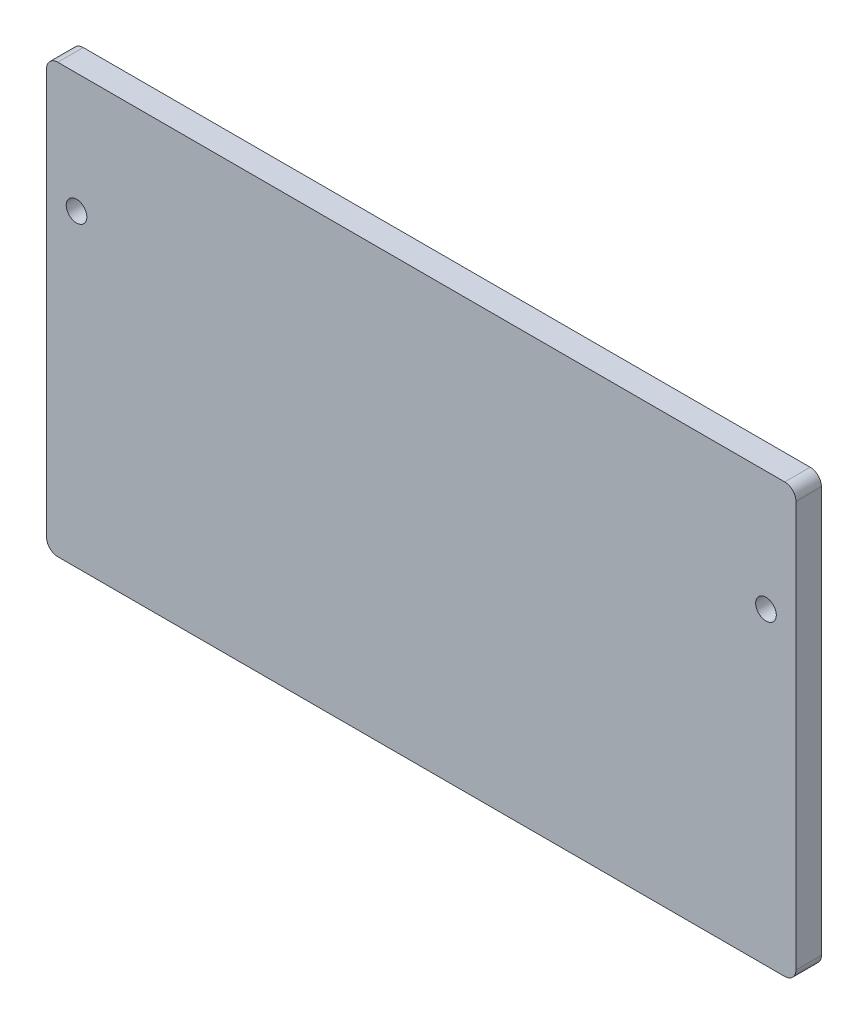
ISO-10303-21;
HEADER;
FILE_DESCRIPTION(('STEP AP214'),'2;1');
FILE_NAME('part.step','',(''),(''),'','','');
FILE_SCHEMA(('AUTOMOTIVE_DESIGN { 1 0 10303 214 1 1 1 1 }'));
ENDSEC;
DATA;
#1=APPLICATION_CONTEXT('core data for automotive mechanical design processes');
#2=APPLICATION_PROTOCOL_DEFINITION('international standard','automotive_design',2000,#1);
#3=PRODUCT_CONTEXT('',#1,'mechanical');
#4=PRODUCT('Part','Part','',(#3));
#5=PRODUCT_RELATED_PRODUCT_CATEGORY('part','',(#4));
#6=PRODUCT_DEFINITION_FORMATION('','',#4);
#7=PRODUCT_DEFINITION_CONTEXT('part definition',#1,'design');
#8=PRODUCT_DEFINITION('design','',#6,#7);
#9=PRODUCT_DEFINITION_SHAPE('','',#8);
#10=(LENGTH_UNIT() NAMED_UNIT(*) SI_UNIT(.MILLI.,.METRE.));
#11=(NAMED_UNIT(*) PLANE_ANGLE_UNIT() SI_UNIT($,.RADIAN.));
#12=(NAMED_UNIT(*) SI_UNIT($,.STERADIAN.) SOLID_ANGLE_UNIT());
#13=UNCERTAINTY_MEASURE_WITH_UNIT(LENGTH_MEASURE(1.E-05),#10,'distance_accuracy_value','');
#14=(GEOMETRIC_REPRESENTATION_CONTEXT(3) GLOBAL_UNCERTAINTY_ASSIGNED_CONTEXT((#13)) GLOBAL_UNIT_ASSIGNED_CONTEXT((#10,
#11,#12)) REPRESENTATION_CONTEXT('',''));
#15=CARTESIAN_POINT('',(0.,0.,0.));
#16=DIRECTION('',(0.,0.,1.));
#17=DIRECTION('',(1.,0.,0.));
#18=AXIS2_PLACEMENT_3D('',#15,#16,#17);
#19=CARTESIAN_POINT('',(0.,0.,6.8));
#20=DIRECTION('',(0.,0.,1.));
#21=DIRECTION('',(1.,0.,0.));
#22=AXIS2_PLACEMENT_3D('',#19,#20,#21);
#23=PLANE('',#22);
#24=CARTESIAN_POINT('',(92.,25.25,6.8));
#25=DIRECTION('',(0.,0.,-1.));
#26=DIRECTION('',(-1.,0.,0.));
#27=AXIS2_PLACEMENT_3D('',#24,#25,#26);
#28=CIRCLE('',#27,2.75000000000001);
#29=CARTESIAN_POINT('',(89.25,25.25,6.8));
#30=VERTEX_POINT('',#29);
#31=EDGE_CURVE('E190',#30,#30,#28,.T.);
#32=ORIENTED_EDGE('',*,*,#31,.T.);
#33=EDGE_LOOP('',(#32));
#34=FACE_BOUND('',#33,.T.);
#35=CARTESIAN_POINT('',(-92.,25.25,6.8));
#36=DIRECTION('',(0.,0.,1.));
#37=DIRECTION('',(1.,0.,0.));
#38=AXIS2_PLACEMENT_3D('',#35,#36,#37);
#39=CIRCLE('',#38,2.75000000000001);
#40=CARTESIAN_POINT('',(-89.25,25.25,6.8));
#41=VERTEX_POINT('',#40);
#42=EDGE_CURVE('E193',#41,#41,#39,.T.);
#43=ORIENTED_EDGE('',*,*,#42,.F.);
#44=EDGE_LOOP('',(#43));
#45=FACE_BOUND('',#44,.T.);
#46=DIRECTION('',(1.,0.,0.));
#47=VECTOR('',#46,1.);
#48=CARTESIAN_POINT('',(100.,-57.15,6.8));
#49=LINE('',#48,#47);
#50=CARTESIAN_POINT('',(-97.,-57.15,6.8));
#51=VERTEX_POINT('',#50);
#52=CARTESIAN_POINT('',(97.,-57.15,6.8));
#53=VERTEX_POINT('',#52);
#54=EDGE_CURVE('E115',#51,#53,#49,.T.);
#55=ORIENTED_EDGE('',*,*,#54,.T.);
#56=CARTESIAN_POINT('',(97.,-54.15,6.8));
#57=DIRECTION('',(0.,0.,-1.));
#58=DIRECTION('',(-1.,0.,0.));
#59=AXIS2_PLACEMENT_3D('',#56,#57,#58);
#60=CIRCLE('',#59,3.);
#61=CARTESIAN_POINT('',(100.,-54.15,6.8));
#62=VERTEX_POINT('',#61);
#63=EDGE_CURVE('E54',#62,#53,#60,.T.);
#64=ORIENTED_EDGE('',*,*,#63,.F.);
#65=DIRECTION('',(0.,1.,0.));
#66=VECTOR('',#65,1.);
#67=CARTESIAN_POINT('',(100.,-57.15,6.8));
#68=LINE('',#67,#66);
#69=CARTESIAN_POINT('',(100.,54.15,6.8));
#70=VERTEX_POINT('',#69);
#71=EDGE_CURVE('E112',#62,#70,#68,.T.);
#72=ORIENTED_EDGE('',*,*,#71,.T.);
#73=CARTESIAN_POINT('',(97.,54.15,6.8));
#74=DIRECTION('',(0.,0.,-1.));
#75=DIRECTION('',(-1.,0.,0.));
#76=AXIS2_PLACEMENT_3D('',#73,#74,#75);
#77=CIRCLE('',#76,3.);
#78=CARTESIAN_POINT('',(97.,57.15,6.8));
#79=VERTEX_POINT('',#78);
#80=EDGE_CURVE('E180',#79,#70,#77,.T.);
#81=ORIENTED_EDGE('',*,*,#80,.F.);
#82=DIRECTION('',(-1.,0.,0.));
#83=VECTOR('',#82,1.);
#84=CARTESIAN_POINT('',(100.,57.15,6.8));
#85=LINE('',#84,#83);
#86=CARTESIAN_POINT('',(-97.,57.15,6.8));
#87=VERTEX_POINT('',#86);
#88=EDGE_CURVE('E119',#79,#87,#85,.T.);
#89=ORIENTED_EDGE('',*,*,#88,.T.);
#90=CARTESIAN_POINT('',(-97.,54.15,6.8));
#91=DIRECTION('',(0.,0.,1.));
#92=DIRECTION('',(1.,0.,0.));
#93=AXIS2_PLACEMENT_3D('',#90,#91,#92);
#94=CIRCLE('',#93,3.);
#95=CARTESIAN_POINT('',(-100.,54.15,6.8));
#96=VERTEX_POINT('',#95);
#97=EDGE_CURVE('E150',#87,#96,#94,.T.);
#98=ORIENTED_EDGE('',*,*,#97,.T.);
#99=DIRECTION('',(0.,-1.,0.));
#100=VECTOR('',#99,1.);
#101=CARTESIAN_POINT('',(-100.,-57.15,6.8));
#102=LINE('',#101,#100);
#103=CARTESIAN_POINT('',(-100.,-54.15,6.8));
#104=VERTEX_POINT('',#103);
#105=EDGE_CURVE('E123',#96,#104,#102,.T.);
#106=ORIENTED_EDGE('',*,*,#105,.T.);
#107=CARTESIAN_POINT('',(-97.,-54.15,6.8));
#108=DIRECTION('',(0.,0.,1.));
#109=DIRECTION('',(1.,0.,0.));
#110=AXIS2_PLACEMENT_3D('',#107,#108,#109);
#111=CIRCLE('',#110,3.);
#112=EDGE_CURVE('E47',#104,#51,#111,.T.);
#113=ORIENTED_EDGE('',*,*,#112,.T.);
#114=EDGE_LOOP('',(#55,#64,#72,#81,#89,#98,#106,#113));
#115=FACE_BOUND('',#114,.T.);
#116=ADVANCED_FACE('F39',(#34,#45,#115),#23,.T.);
#117=CARTESIAN_POINT('',(0.,0.,0.));
#118=DIRECTION('',(0.,0.,1.));
#119=DIRECTION('',(1.,0.,0.));
#120=AXIS2_PLACEMENT_3D('',#117,#118,#119);
#121=PLANE('',#120);
#122=CARTESIAN_POINT('',(92.,25.25,0.));
#123=DIRECTION('',(0.,0.,-1.));
#124=DIRECTION('',(-1.,0.,0.));
#125=AXIS2_PLACEMENT_3D('',#122,#123,#124);
#126=CIRCLE('',#125,2.75000000000001);
#127=CARTESIAN_POINT('',(89.25,25.25,0.));
#128=VERTEX_POINT('',#127);
#129=EDGE_CURVE('E187',#128,#128,#126,.T.);
#130=ORIENTED_EDGE('',*,*,#129,.F.);
#131=EDGE_LOOP('',(#130));
#132=FACE_BOUND('',#131,.T.);
#133=CARTESIAN_POINT('',(-92.,25.25,0.));
#134=DIRECTION('',(0.,0.,1.));
#135=DIRECTION('',(1.,0.,0.));
#136=AXIS2_PLACEMENT_3D('',#133,#134,#135);
#137=CIRCLE('',#136,2.75000000000001);
#138=CARTESIAN_POINT('',(-89.25,25.25,0.));
#139=VERTEX_POINT('',#138);
#140=EDGE_CURVE('E132',#139,#139,#137,.T.);
#141=ORIENTED_EDGE('',*,*,#140,.T.);
#142=EDGE_LOOP('',(#141));
#143=FACE_BOUND('',#142,.T.);
#144=CARTESIAN_POINT('',(97.,-54.15,0.));
#145=DIRECTION('',(0.,0.,-1.));
#146=DIRECTION('',(-1.,0.,0.));
#147=AXIS2_PLACEMENT_3D('',#144,#145,#146);
#148=CIRCLE('',#147,3.);
#149=CARTESIAN_POINT('',(97.,-57.15,0.));
#150=VERTEX_POINT('',#149);
#151=CARTESIAN_POINT('',(100.,-54.15,0.));
#152=VERTEX_POINT('',#151);
#153=EDGE_CURVE('E106',#150,#152,#148,.F.);
#154=ORIENTED_EDGE('',*,*,#153,.F.);
#155=DIRECTION('',(1.,0.,0.));
#156=VECTOR('',#155,1.);
#157=CARTESIAN_POINT('',(100.,-57.15,0.));
#158=LINE('',#157,#156);
#159=CARTESIAN_POINT('',(-97.,-57.15,0.));
#160=VERTEX_POINT('',#159);
#161=EDGE_CURVE('E131',#160,#150,#158,.T.);
#162=ORIENTED_EDGE('',*,*,#161,.F.);
#163=CARTESIAN_POINT('',(-97.,-54.15,0.));
#164=DIRECTION('',(0.,0.,1.));
#165=DIRECTION('',(1.,0.,0.));
#166=AXIS2_PLACEMENT_3D('',#163,#164,#165);
#167=CIRCLE('',#166,3.);
#168=CARTESIAN_POINT('',(-100.,-54.15,0.));
#169=VERTEX_POINT('',#168);
#170=EDGE_CURVE('E143',#160,#169,#167,.F.);
#171=ORIENTED_EDGE('',*,*,#170,.T.);
#172=DIRECTION('',(0.,-1.,0.));
#173=VECTOR('',#172,1.);
#174=CARTESIAN_POINT('',(-100.,-57.15,0.));
#175=LINE('',#174,#173);
#176=CARTESIAN_POINT('',(-100.,54.15,0.));
#177=VERTEX_POINT('',#176);
#178=EDGE_CURVE('E127',#177,#169,#175,.T.);
#179=ORIENTED_EDGE('',*,*,#178,.F.);
#180=CARTESIAN_POINT('',(-97.,54.15,0.));
#181=DIRECTION('',(0.,0.,1.));
#182=DIRECTION('',(1.,0.,0.));
#183=AXIS2_PLACEMENT_3D('',#180,#181,#182);
#184=CIRCLE('',#183,3.);
#185=CARTESIAN_POINT('',(-97.,57.15,0.));
#186=VERTEX_POINT('',#185);
#187=EDGE_CURVE('E140',#177,#186,#184,.F.);
#188=ORIENTED_EDGE('',*,*,#187,.T.);
#189=DIRECTION('',(-1.,0.,0.));
#190=VECTOR('',#189,1.);
#191=CARTESIAN_POINT('',(100.,57.15,0.));
#192=LINE('',#191,#190);
#193=CARTESIAN_POINT('',(97.,57.15,0.));
#194=VERTEX_POINT('',#193);
#195=EDGE_CURVE('E136',#194,#186,#192,.T.);
#196=ORIENTED_EDGE('',*,*,#195,.F.);
#197=CARTESIAN_POINT('',(97.,54.15,0.));
#198=DIRECTION('',(0.,0.,-1.));
#199=DIRECTION('',(-1.,0.,0.));
#200=AXIS2_PLACEMENT_3D('',#197,#198,#199);
#201=CIRCLE('',#200,3.);
#202=CARTESIAN_POINT('',(100.,54.15,0.));
#203=VERTEX_POINT('',#202);
#204=EDGE_CURVE('E173',#203,#194,#201,.F.);
#205=ORIENTED_EDGE('',*,*,#204,.F.);
#206=DIRECTION('',(0.,1.,0.));
#207=VECTOR('',#206,1.);
#208=CARTESIAN_POINT('',(100.,-57.15,0.));
#209=LINE('',#208,#207);
#210=EDGE_CURVE('E62',#152,#203,#209,.T.);
#211=ORIENTED_EDGE('',*,*,#210,.F.);
#212=EDGE_LOOP('',(#154,#162,#171,#179,#188,#196,#205,#211));
#213=FACE_BOUND('',#212,.T.);
#214=ADVANCED_FACE('F164',(#132,#143,#213),#121,.F.);
#215=CARTESIAN_POINT('',(100.,-57.15,6.8));
#216=DIRECTION('',(0.,1.,0.));
#217=DIRECTION('',(-1.,0.,0.));
#218=AXIS2_PLACEMENT_3D('',#215,#216,#217);
#219=PLANE('',#218);
#220=DIRECTION('',(0.,0.,-1.));
#221=VECTOR('',#220,1.);
#222=CARTESIAN_POINT('',(97.,-57.15,6.8));
#223=LINE('',#222,#221);
#224=EDGE_CURVE('E160',#53,#150,#223,.T.);
#225=ORIENTED_EDGE('',*,*,#224,.F.);
#226=ORIENTED_EDGE('',*,*,#54,.F.);
#227=DIRECTION('',(0.,0.,-1.));
#228=VECTOR('',#227,1.);
#229=CARTESIAN_POINT('',(-97.,-57.15,6.8));
#230=LINE('',#229,#228);
#231=EDGE_CURVE('E121',#51,#160,#230,.T.);
#232=ORIENTED_EDGE('',*,*,#231,.T.);
#233=ORIENTED_EDGE('',*,*,#161,.T.);
#234=EDGE_LOOP('',(#225,#226,#232,#233));
#235=FACE_BOUND('',#234,.T.);
#236=ADVANCED_FACE('F158',(#235),#219,.F.);
#237=CARTESIAN_POINT('',(100.,-57.15,6.8));
#238=DIRECTION('',(-1.,0.,0.));
#239=DIRECTION('',(0.,0.,1.));
#240=AXIS2_PLACEMENT_3D('',#237,#238,#239);
#241=PLANE('',#240);
#242=ORIENTED_EDGE('',*,*,#71,.F.);
#243=DIRECTION('',(0.,0.,-1.));
#244=VECTOR('',#243,1.);
#245=CARTESIAN_POINT('',(100.,-54.15,6.8));
#246=LINE('',#245,#244);
#247=EDGE_CURVE('E103',#152,#62,#246,.F.);
#248=ORIENTED_EDGE('',*,*,#247,.F.);
#249=ORIENTED_EDGE('',*,*,#210,.T.);
#250=DIRECTION('',(0.,0.,-1.));
#251=VECTOR('',#250,1.);
#252=CARTESIAN_POINT('',(100.,54.15,6.8));
#253=LINE('',#252,#251);
#254=EDGE_CURVE('E118',#70,#203,#253,.T.);
#255=ORIENTED_EDGE('',*,*,#254,.F.);
#256=EDGE_LOOP('',(#242,#248,#249,#255));
#257=FACE_BOUND('',#256,.T.);
#258=ADVANCED_FACE('F117',(#257),#241,.F.);
#259=CARTESIAN_POINT('',(-100.,-57.15,6.8));
#260=DIRECTION('',(1.,0.,0.));
#261=DIRECTION('',(0.,0.,-1.));
#262=AXIS2_PLACEMENT_3D('',#259,#260,#261);
#263=PLANE('',#262);
#264=ORIENTED_EDGE('',*,*,#178,.T.);
#265=DIRECTION('',(0.,0.,-1.));
#266=VECTOR('',#265,1.);
#267=CARTESIAN_POINT('',(-100.,-54.15,6.8));
#268=LINE('',#267,#266);
#269=EDGE_CURVE('E148',#169,#104,#268,.F.);
#270=ORIENTED_EDGE('',*,*,#269,.T.);
#271=ORIENTED_EDGE('',*,*,#105,.F.);
#272=DIRECTION('',(0.,0.,-1.));
#273=VECTOR('',#272,1.);
#274=CARTESIAN_POINT('',(-100.,54.15,6.8));
#275=LINE('',#274,#273);
#276=EDGE_CURVE('E145',#96,#177,#275,.T.);
#277=ORIENTED_EDGE('',*,*,#276,.T.);
#278=EDGE_LOOP('',(#264,#270,#271,#277));
#279=FACE_BOUND('',#278,.T.);
#280=ADVANCED_FACE('F166',(#279),#263,.F.);
#281=CARTESIAN_POINT('',(100.,57.15,6.8));
#282=DIRECTION('',(0.,-1.,0.));
#283=DIRECTION('',(1.,0.,0.));
#284=AXIS2_PLACEMENT_3D('',#281,#282,#283);
#285=PLANE('',#284);
#286=ORIENTED_EDGE('',*,*,#88,.F.);
#287=DIRECTION('',(0.,0.,-1.));
#288=VECTOR('',#287,1.);
#289=CARTESIAN_POINT('',(97.,57.15,6.8));
#290=LINE('',#289,#288);
#291=EDGE_CURVE('E178',#194,#79,#290,.F.);
#292=ORIENTED_EDGE('',*,*,#291,.F.);
#293=ORIENTED_EDGE('',*,*,#195,.T.);
#294=DIRECTION('',(0.,0.,-1.));
#295=VECTOR('',#294,1.);
#296=CARTESIAN_POINT('',(-97.,57.15,6.8));
#297=LINE('',#296,#295);
#298=EDGE_CURVE('E11',#186,#87,#297,.F.);
#299=ORIENTED_EDGE('',*,*,#298,.T.);
#300=EDGE_LOOP('',(#286,#292,#293,#299));
#301=FACE_BOUND('',#300,.T.);
#302=ADVANCED_FACE('F177',(#301),#285,.F.);
#303=CARTESIAN_POINT('',(-92.,25.25,0.));
#304=DIRECTION('',(0.,0.,1.));
#305=DIRECTION('',(1.,0.,0.));
#306=AXIS2_PLACEMENT_3D('',#303,#304,#305);
#307=CYLINDRICAL_SURFACE('',#306,2.75000000000001);
#308=ORIENTED_EDGE('',*,*,#140,.F.);
#309=EDGE_LOOP('',(#308));
#310=FACE_BOUND('',#309,.T.);
#311=ORIENTED_EDGE('',*,*,#42,.T.);
#312=EDGE_LOOP('',(#311));
#313=FACE_BOUND('',#312,.T.);
#314=ADVANCED_FACE('F202',(#310,#313),#307,.F.);
#315=CARTESIAN_POINT('',(-97.,-54.15,6.8));
#316=DIRECTION('',(0.,0.,-1.));
#317=DIRECTION('',(-1.,0.,0.));
#318=AXIS2_PLACEMENT_3D('',#315,#316,#317);
#319=CYLINDRICAL_SURFACE('',#318,3.);
#320=ORIENTED_EDGE('',*,*,#112,.F.);
#321=ORIENTED_EDGE('',*,*,#269,.F.);
#322=ORIENTED_EDGE('',*,*,#170,.F.);
#323=ORIENTED_EDGE('',*,*,#231,.F.);
#324=EDGE_LOOP('',(#320,#321,#322,#323));
#325=FACE_BOUND('',#324,.T.);
#326=ADVANCED_FACE('F161',(#325),#319,.T.);
#327=CARTESIAN_POINT('',(-97.,54.15,6.8));
#328=DIRECTION('',(0.,0.,-1.));
#329=DIRECTION('',(-1.,0.,0.));
#330=AXIS2_PLACEMENT_3D('',#327,#328,#329);
#331=CYLINDRICAL_SURFACE('',#330,3.);
#332=ORIENTED_EDGE('',*,*,#97,.F.);
#333=ORIENTED_EDGE('',*,*,#298,.F.);
#334=ORIENTED_EDGE('',*,*,#187,.F.);
#335=ORIENTED_EDGE('',*,*,#276,.F.);
#336=EDGE_LOOP('',(#332,#333,#334,#335));
#337=FACE_BOUND('',#336,.T.);
#338=ADVANCED_FACE('F41',(#337),#331,.T.);
#339=CARTESIAN_POINT('',(92.,25.25,0.));
#340=DIRECTION('',(0.,0.,1.));
#341=DIRECTION('',(-1.,0.,0.));
#342=AXIS2_PLACEMENT_3D('',#339,#340,#341);
#343=CYLINDRICAL_SURFACE('',#342,2.75000000000001);
#344=ORIENTED_EDGE('',*,*,#129,.T.);
#345=EDGE_LOOP('',(#344));
#346=FACE_BOUND('',#345,.T.);
#347=ORIENTED_EDGE('',*,*,#31,.F.);
#348=EDGE_LOOP('',(#347));
#349=FACE_BOUND('',#348,.T.);
#350=ADVANCED_FACE('F227',(#346,#349),#343,.F.);
#351=CARTESIAN_POINT('',(97.,54.15,6.8));
#352=DIRECTION('',(0.,0.,-1.));
#353=DIRECTION('',(1.,0.,0.));
#354=AXIS2_PLACEMENT_3D('',#351,#352,#353);
#355=CYLINDRICAL_SURFACE('',#354,3.);
#356=ORIENTED_EDGE('',*,*,#80,.T.);
#357=ORIENTED_EDGE('',*,*,#254,.T.);
#358=ORIENTED_EDGE('',*,*,#204,.T.);
#359=ORIENTED_EDGE('',*,*,#291,.T.);
#360=EDGE_LOOP('',(#356,#357,#358,#359));
#361=FACE_BOUND('',#360,.T.);
#362=ADVANCED_FACE('F280',(#361),#355,.T.);
#363=CARTESIAN_POINT('',(97.,-54.15,6.8));
#364=DIRECTION('',(0.,0.,-1.));
#365=DIRECTION('',(1.,0.,0.));
#366=AXIS2_PLACEMENT_3D('',#363,#364,#365);
#367=CYLINDRICAL_SURFACE('',#366,3.);
#368=ORIENTED_EDGE('',*,*,#63,.T.);
#369=ORIENTED_EDGE('',*,*,#224,.T.);
#370=ORIENTED_EDGE('',*,*,#153,.T.);
#371=ORIENTED_EDGE('',*,*,#247,.T.);
#372=EDGE_LOOP('',(#368,#369,#370,#371));
#373=FACE_BOUND('',#372,.T.);
#374=ADVANCED_FACE('F104',(#373),#367,.T.);
#375=CLOSED_SHELL('',(#116,#214,#236,#258,#280,#302,#314,#326,#338,#350,#362,#374));
#376=MANIFOLD_SOLID_BREP('B2',#375);
#377=ADVANCED_BREP_SHAPE_REPRESENTATION('',(#18,#376),#14);
#378=SHAPE_DEFINITION_REPRESENTATION(#9,#377);
ENDSEC;
END-ISO-10303-21;
